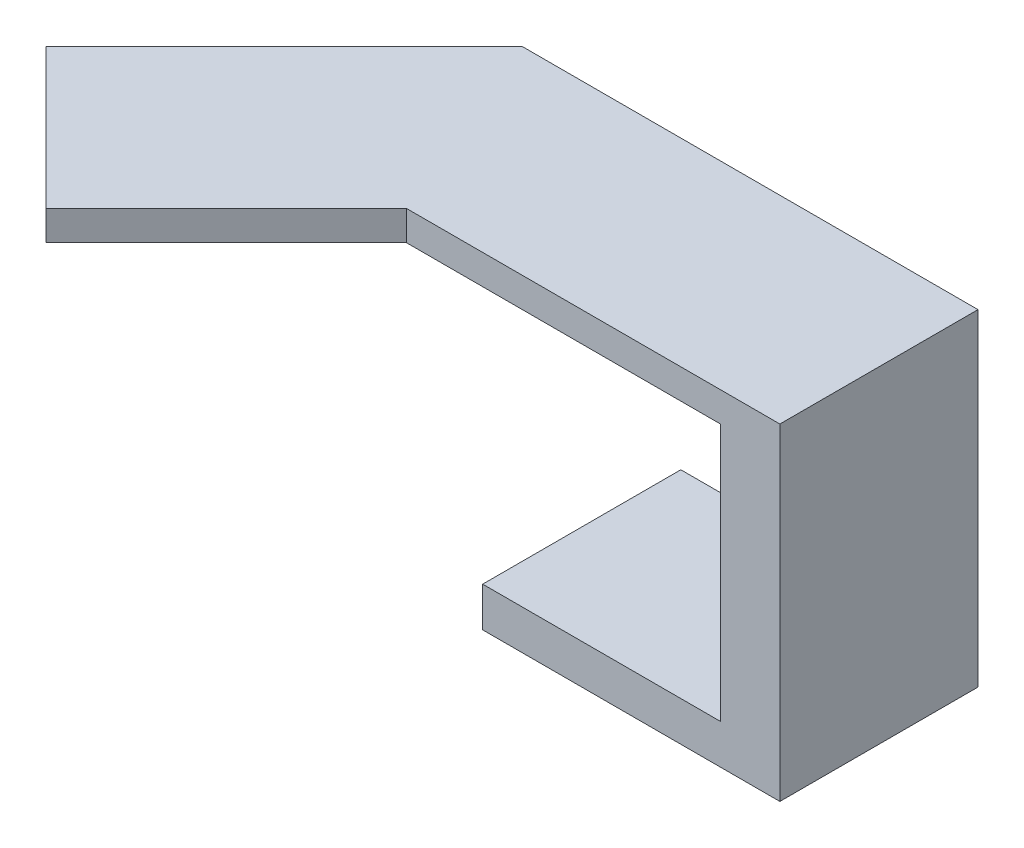
ISO-10303-21;
HEADER;
FILE_DESCRIPTION(('STEP AP214'),'2;1');
FILE_NAME('part.step','',(''),(''),'','','');
FILE_SCHEMA(('AUTOMOTIVE_DESIGN { 1 0 10303 214 1 1 1 1 }'));
ENDSEC;
DATA;
#1=APPLICATION_CONTEXT('core data for automotive mechanical design processes');
#2=APPLICATION_PROTOCOL_DEFINITION('international standard','automotive_design',2000,#1);
#3=PRODUCT_CONTEXT('',#1,'mechanical');
#4=PRODUCT('Part','Part','',(#3));
#5=PRODUCT_RELATED_PRODUCT_CATEGORY('part','',(#4));
#6=PRODUCT_DEFINITION_FORMATION('','',#4);
#7=PRODUCT_DEFINITION_CONTEXT('part definition',#1,'design');
#8=PRODUCT_DEFINITION('design','',#6,#7);
#9=PRODUCT_DEFINITION_SHAPE('','',#8);
#10=(LENGTH_UNIT() NAMED_UNIT(*) SI_UNIT(.MILLI.,.METRE.));
#11=(NAMED_UNIT(*) PLANE_ANGLE_UNIT() SI_UNIT($,.RADIAN.));
#12=(NAMED_UNIT(*) SI_UNIT($,.STERADIAN.) SOLID_ANGLE_UNIT());
#13=UNCERTAINTY_MEASURE_WITH_UNIT(LENGTH_MEASURE(1.E-05),#10,'distance_accuracy_value','');
#14=(GEOMETRIC_REPRESENTATION_CONTEXT(3) GLOBAL_UNCERTAINTY_ASSIGNED_CONTEXT((#13)) GLOBAL_UNIT_ASSIGNED_CONTEXT((#10,
#11,#12)) REPRESENTATION_CONTEXT('',''));
#15=CARTESIAN_POINT('',(0.,0.,0.));
#16=DIRECTION('',(0.,0.,1.));
#17=DIRECTION('',(1.,0.,0.));
#18=AXIS2_PLACEMENT_3D('',#15,#16,#17);
#19=CARTESIAN_POINT('',(9.74684507044105,-15.,5.54210655236567));
#20=DIRECTION('',(1.,0.,0.));
#21=DIRECTION('',(0.,0.,-1.));
#22=AXIS2_PLACEMENT_3D('',#19,#20,#21);
#23=PLANE('',#22);
#24=DIRECTION('',(0.,0.,-1.));
#25=VECTOR('',#24,1.);
#26=CARTESIAN_POINT('',(9.74684507044105,-13.,-4.45789344763433));
#27=LINE('',#26,#25);
#28=CARTESIAN_POINT('',(9.74684507044105,-13.,5.54210655236567));
#29=VERTEX_POINT('',#28);
#30=CARTESIAN_POINT('',(9.74684507044105,-13.,-4.45789344763433));
#31=VERTEX_POINT('',#30);
#32=EDGE_CURVE('E178',#29,#31,#27,.T.);
#33=ORIENTED_EDGE('',*,*,#32,.F.);
#34=DIRECTION('',(0.,1.,0.));
#35=VECTOR('',#34,1.);
#36=CARTESIAN_POINT('',(9.74684507044105,-15.,5.54210655236567));
#37=LINE('',#36,#35);
#38=CARTESIAN_POINT('',(9.74684507044105,0.,5.54210655236567));
#39=VERTEX_POINT('',#38);
#40=EDGE_CURVE('E48',#29,#39,#37,.T.);
#41=ORIENTED_EDGE('',*,*,#40,.T.);
#42=DIRECTION('',(0.,0.,-1.));
#43=VECTOR('',#42,1.);
#44=CARTESIAN_POINT('',(9.74684507044105,0.,5.54210655236567));
#45=LINE('',#44,#43);
#46=CARTESIAN_POINT('',(9.74684507044105,0.,-4.45789344763433));
#47=VERTEX_POINT('',#46);
#48=EDGE_CURVE('E142',#39,#47,#45,.T.);
#49=ORIENTED_EDGE('',*,*,#48,.T.);
#50=DIRECTION('',(0.,1.,0.));
#51=VECTOR('',#50,1.);
#52=CARTESIAN_POINT('',(9.74684507044105,-15.,-4.45789344763433));
#53=LINE('',#52,#51);
#54=EDGE_CURVE('E161',#31,#47,#53,.T.);
#55=ORIENTED_EDGE('',*,*,#54,.F.);
#56=EDGE_LOOP('',(#33,#41,#49,#55));
#57=FACE_BOUND('',#56,.T.);
#58=ADVANCED_FACE('F33',(#57),#23,.F.);
#59=CARTESIAN_POINT('',(12.7468450704411,1.5,5.54210655236567));
#60=DIRECTION('',(-1.,0.,0.));
#61=DIRECTION('',(0.,0.,1.));
#62=AXIS2_PLACEMENT_3D('',#59,#60,#61);
#63=PLANE('',#62);
#64=DIRECTION('',(0.,-1.,0.));
#65=VECTOR('',#64,1.);
#66=CARTESIAN_POINT('',(12.7468450704411,1.5,5.54210655236567));
#67=LINE('',#66,#65);
#68=CARTESIAN_POINT('',(12.7468450704411,1.5,5.54210655236567));
#69=VERTEX_POINT('',#68);
#70=CARTESIAN_POINT('',(12.7468450704411,-15.,5.54210655236567));
#71=VERTEX_POINT('',#70);
#72=EDGE_CURVE('E117',#69,#71,#67,.T.);
#73=ORIENTED_EDGE('',*,*,#72,.T.);
#74=DIRECTION('',(0.,0.,1.));
#75=VECTOR('',#74,1.);
#76=CARTESIAN_POINT('',(12.7468450704411,-15.,5.54210655236567));
#77=LINE('',#76,#75);
#78=CARTESIAN_POINT('',(12.7468450704411,-15.,-4.45789344763433));
#79=VERTEX_POINT('',#78);
#80=EDGE_CURVE('E166',#79,#71,#77,.T.);
#81=ORIENTED_EDGE('',*,*,#80,.F.);
#82=DIRECTION('',(0.,-1.,0.));
#83=VECTOR('',#82,1.);
#84=CARTESIAN_POINT('',(12.7468450704411,1.5,-4.45789344763433));
#85=LINE('',#84,#83);
#86=CARTESIAN_POINT('',(12.7468450704411,1.5,-4.45789344763433));
#87=VERTEX_POINT('',#86);
#88=EDGE_CURVE('E11',#87,#79,#85,.T.);
#89=ORIENTED_EDGE('',*,*,#88,.F.);
#90=DIRECTION('',(0.,0.,-1.));
#91=VECTOR('',#90,1.);
#92=CARTESIAN_POINT('',(12.7468450704411,1.5,5.54210655236567));
#93=LINE('',#92,#91);
#94=EDGE_CURVE('E130',#69,#87,#93,.T.);
#95=ORIENTED_EDGE('',*,*,#94,.F.);
#96=EDGE_LOOP('',(#73,#81,#89,#95));
#97=FACE_BOUND('',#96,.T.);
#98=ADVANCED_FACE('F35',(#97),#63,.F.);
#99=CARTESIAN_POINT('',(-10.2531549295589,1.5,-4.45789344763433));
#100=DIRECTION('',(0.,0.,1.));
#101=DIRECTION('',(1.,0.,0.));
#102=AXIS2_PLACEMENT_3D('',#99,#100,#101);
#103=PLANE('',#102);
#104=ORIENTED_EDGE('',*,*,#88,.T.);
#105=DIRECTION('',(1.,0.,0.));
#106=VECTOR('',#105,1.);
#107=CARTESIAN_POINT('',(12.7468450704411,-15.,-4.45789344763433));
#108=LINE('',#107,#106);
#109=CARTESIAN_POINT('',(-2.25315492955895,-15.,-4.45789344763433));
#110=VERTEX_POINT('',#109);
#111=EDGE_CURVE('E164',#110,#79,#108,.T.);
#112=ORIENTED_EDGE('',*,*,#111,.F.);
#113=DIRECTION('',(0.,-1.,0.));
#114=VECTOR('',#113,1.);
#115=CARTESIAN_POINT('',(-2.25315492955895,-15.,-4.45789344763433));
#116=LINE('',#115,#114);
#117=CARTESIAN_POINT('',(-2.25315492955895,-13.,-4.45789344763433));
#118=VERTEX_POINT('',#117);
#119=EDGE_CURVE('E181',#118,#110,#116,.T.);
#120=ORIENTED_EDGE('',*,*,#119,.F.);
#121=DIRECTION('',(1.,0.,0.));
#122=VECTOR('',#121,1.);
#123=CARTESIAN_POINT('',(-2.25315492955895,-13.,-4.45789344763433));
#124=LINE('',#123,#122);
#125=EDGE_CURVE('E174',#118,#31,#124,.T.);
#126=ORIENTED_EDGE('',*,*,#125,.T.);
#127=ORIENTED_EDGE('',*,*,#54,.T.);
#128=DIRECTION('',(-1.,0.,0.));
#129=VECTOR('',#128,1.);
#130=CARTESIAN_POINT('',(-10.2531549295589,0.,-4.45789344763433));
#131=LINE('',#130,#129);
#132=CARTESIAN_POINT('',(-10.2531549295589,0.,-4.45789344763433));
#133=VERTEX_POINT('',#132);
#134=EDGE_CURVE('E121',#47,#133,#131,.T.);
#135=ORIENTED_EDGE('',*,*,#134,.T.);
#136=DIRECTION('',(0.,-1.,0.));
#137=VECTOR('',#136,1.);
#138=CARTESIAN_POINT('',(-10.2531549295589,1.5,-4.45789344763433));
#139=LINE('',#138,#137);
#140=CARTESIAN_POINT('',(-10.2531549295589,1.5,-4.45789344763433));
#141=VERTEX_POINT('',#140);
#142=EDGE_CURVE('E41',#141,#133,#139,.T.);
#143=ORIENTED_EDGE('',*,*,#142,.F.);
#144=DIRECTION('',(-1.,0.,0.));
#145=VECTOR('',#144,1.);
#146=CARTESIAN_POINT('',(-10.2531549295589,1.5,-4.45789344763433));
#147=LINE('',#146,#145);
#148=EDGE_CURVE('E87',#87,#141,#147,.T.);
#149=ORIENTED_EDGE('',*,*,#148,.F.);
#150=EDGE_LOOP('',(#104,#112,#120,#126,#127,#135,#143,#149));
#151=FACE_BOUND('',#150,.T.);
#152=ADVANCED_FACE('F203',(#151),#103,.F.);
#153=CARTESIAN_POINT('',(-10.2531549295589,1.5,-4.45789344763433));
#154=DIRECTION('',(0.707106781186544,0.,0.707106781186551));
#155=DIRECTION('',(0.707106781186551,0.,-0.707106781186544));
#156=AXIS2_PLACEMENT_3D('',#153,#154,#155);
#157=PLANE('',#156);
#158=DIRECTION('',(-0.707106781186551,0.,0.707106781186544));
#159=VECTOR('',#158,1.);
#160=CARTESIAN_POINT('',(-10.2531549295589,0.,-4.45789344763433));
#161=LINE('',#160,#159);
#162=CARTESIAN_POINT('',(-22.2739702097303,0.,7.56292183253692));
#163=VERTEX_POINT('',#162);
#164=EDGE_CURVE('E123',#133,#163,#161,.T.);
#165=ORIENTED_EDGE('',*,*,#164,.T.);
#166=DIRECTION('',(0.,-1.,0.));
#167=VECTOR('',#166,1.);
#168=CARTESIAN_POINT('',(-22.2739702097303,1.5,7.56292183253692));
#169=LINE('',#168,#167);
#170=CARTESIAN_POINT('',(-22.2739702097303,1.5,7.56292183253692));
#171=VERTEX_POINT('',#170);
#172=EDGE_CURVE('E112',#171,#163,#169,.T.);
#173=ORIENTED_EDGE('',*,*,#172,.F.);
#174=DIRECTION('',(-0.707106781186551,0.,0.707106781186544));
#175=VECTOR('',#174,1.);
#176=CARTESIAN_POINT('',(-10.2531549295589,1.5,-4.45789344763433));
#177=LINE('',#176,#175);
#178=EDGE_CURVE('E103',#141,#171,#177,.T.);
#179=ORIENTED_EDGE('',*,*,#178,.F.);
#180=ORIENTED_EDGE('',*,*,#142,.T.);
#181=EDGE_LOOP('',(#165,#173,#179,#180));
#182=FACE_BOUND('',#181,.T.);
#183=ADVANCED_FACE('F137',(#182),#157,.F.);
#184=CARTESIAN_POINT('',(-22.2739702097303,1.5,7.56292183253692));
#185=DIRECTION('',(0.707106781186551,0.,-0.707106781186544));
#186=DIRECTION('',(-0.707106781186544,0.,-0.707106781186551));
#187=AXIS2_PLACEMENT_3D('',#184,#185,#186);
#188=PLANE('',#187);
#189=DIRECTION('',(0.707106781186544,0.,0.707106781186551));
#190=VECTOR('',#189,1.);
#191=CARTESIAN_POINT('',(-22.2739702097303,0.,7.56292183253692));
#192=LINE('',#191,#190);
#193=CARTESIAN_POINT('',(-15.2029023978649,0.,14.6339896444024));
#194=VERTEX_POINT('',#193);
#195=EDGE_CURVE('E111',#163,#194,#192,.T.);
#196=ORIENTED_EDGE('',*,*,#195,.T.);
#197=DIRECTION('',(0.,-1.,0.));
#198=VECTOR('',#197,1.);
#199=CARTESIAN_POINT('',(-15.2029023978649,1.5,14.6339896444024));
#200=LINE('',#199,#198);
#201=CARTESIAN_POINT('',(-15.2029023978649,1.5,14.6339896444024));
#202=VERTEX_POINT('',#201);
#203=EDGE_CURVE('E108',#202,#194,#200,.T.);
#204=ORIENTED_EDGE('',*,*,#203,.F.);
#205=DIRECTION('',(0.707106781186544,0.,0.707106781186551));
#206=VECTOR('',#205,1.);
#207=CARTESIAN_POINT('',(-22.2739702097303,1.5,7.56292183253692));
#208=LINE('',#207,#206);
#209=EDGE_CURVE('E97',#171,#202,#208,.T.);
#210=ORIENTED_EDGE('',*,*,#209,.F.);
#211=ORIENTED_EDGE('',*,*,#172,.T.);
#212=EDGE_LOOP('',(#196,#204,#210,#211));
#213=FACE_BOUND('',#212,.T.);
#214=ADVANCED_FACE('F109',(#213),#188,.F.);
#215=CARTESIAN_POINT('',(-15.2029023978649,1.5,14.6339896444024));
#216=DIRECTION('',(-0.707106781186544,0.,-0.707106781186551));
#217=DIRECTION('',(-0.707106781186551,0.,0.707106781186544));
#218=AXIS2_PLACEMENT_3D('',#215,#216,#217);
#219=PLANE('',#218);
#220=DIRECTION('',(0.707106781186551,0.,-0.707106781186544));
#221=VECTOR('',#220,1.);
#222=CARTESIAN_POINT('',(-15.2029023978649,0.,14.6339896444024));
#223=LINE('',#222,#221);
#224=CARTESIAN_POINT('',(-6.11101930582803,0.,5.54210655236567));
#225=VERTEX_POINT('',#224);
#226=EDGE_CURVE('E79',#194,#225,#223,.T.);
#227=ORIENTED_EDGE('',*,*,#226,.T.);
#228=DIRECTION('',(0.,-1.,0.));
#229=VECTOR('',#228,1.);
#230=CARTESIAN_POINT('',(-6.11101930582803,1.5,5.54210655236567));
#231=LINE('',#230,#229);
#232=CARTESIAN_POINT('',(-6.11101930582803,1.5,5.54210655236567));
#233=VERTEX_POINT('',#232);
#234=EDGE_CURVE('E113',#233,#225,#231,.T.);
#235=ORIENTED_EDGE('',*,*,#234,.F.);
#236=DIRECTION('',(0.707106781186551,0.,-0.707106781186544));
#237=VECTOR('',#236,1.);
#238=CARTESIAN_POINT('',(-15.2029023978649,1.5,14.6339896444024));
#239=LINE('',#238,#237);
#240=EDGE_CURVE('E101',#202,#233,#239,.T.);
#241=ORIENTED_EDGE('',*,*,#240,.F.);
#242=ORIENTED_EDGE('',*,*,#203,.T.);
#243=EDGE_LOOP('',(#227,#235,#241,#242));
#244=FACE_BOUND('',#243,.T.);
#245=ADVANCED_FACE('F115',(#244),#219,.F.);
#246=CARTESIAN_POINT('',(-6.11101930582803,1.5,5.54210655236567));
#247=DIRECTION('',(0.,0.,-1.));
#248=DIRECTION('',(-1.,0.,0.));
#249=AXIS2_PLACEMENT_3D('',#246,#247,#248);
#250=PLANE('',#249);
#251=DIRECTION('',(1.,0.,0.));
#252=VECTOR('',#251,1.);
#253=CARTESIAN_POINT('',(-6.11101930582803,0.,5.54210655236567));
#254=LINE('',#253,#252);
#255=EDGE_CURVE('E127',#225,#39,#254,.T.);
#256=ORIENTED_EDGE('',*,*,#255,.T.);
#257=ORIENTED_EDGE('',*,*,#40,.F.);
#258=DIRECTION('',(1.,0.,0.));
#259=VECTOR('',#258,1.);
#260=CARTESIAN_POINT('',(-2.25315492955895,-13.,5.54210655236567));
#261=LINE('',#260,#259);
#262=CARTESIAN_POINT('',(-2.25315492955895,-13.,5.54210655236567));
#263=VERTEX_POINT('',#262);
#264=EDGE_CURVE('E167',#263,#29,#261,.T.);
#265=ORIENTED_EDGE('',*,*,#264,.F.);
#266=DIRECTION('',(0.,1.,0.));
#267=VECTOR('',#266,1.);
#268=CARTESIAN_POINT('',(-2.25315492955895,-15.,5.54210655236567));
#269=LINE('',#268,#267);
#270=CARTESIAN_POINT('',(-2.25315492955895,-15.,5.54210655236567));
#271=VERTEX_POINT('',#270);
#272=EDGE_CURVE('E184',#271,#263,#269,.T.);
#273=ORIENTED_EDGE('',*,*,#272,.F.);
#274=DIRECTION('',(-1.,0.,0.));
#275=VECTOR('',#274,1.);
#276=CARTESIAN_POINT('',(12.7468450704411,-15.,5.54210655236567));
#277=LINE('',#276,#275);
#278=EDGE_CURVE('E152',#71,#271,#277,.T.);
#279=ORIENTED_EDGE('',*,*,#278,.F.);
#280=ORIENTED_EDGE('',*,*,#72,.F.);
#281=DIRECTION('',(1.,0.,0.));
#282=VECTOR('',#281,1.);
#283=CARTESIAN_POINT('',(-6.11101930582803,1.5,5.54210655236567));
#284=LINE('',#283,#282);
#285=EDGE_CURVE('E57',#233,#69,#284,.T.);
#286=ORIENTED_EDGE('',*,*,#285,.F.);
#287=ORIENTED_EDGE('',*,*,#234,.T.);
#288=EDGE_LOOP('',(#256,#257,#265,#273,#279,#280,#286,#287));
#289=FACE_BOUND('',#288,.T.);
#290=ADVANCED_FACE('F144',(#289),#250,.F.);
#291=CARTESIAN_POINT('',(0.,1.5,0.));
#292=DIRECTION('',(0.,-1.,0.));
#293=DIRECTION('',(0.,0.,-1.));
#294=AXIS2_PLACEMENT_3D('',#291,#292,#293);
#295=PLANE('',#294);
#296=ORIENTED_EDGE('',*,*,#94,.T.);
#297=ORIENTED_EDGE('',*,*,#148,.T.);
#298=ORIENTED_EDGE('',*,*,#178,.T.);
#299=ORIENTED_EDGE('',*,*,#209,.T.);
#300=ORIENTED_EDGE('',*,*,#240,.T.);
#301=ORIENTED_EDGE('',*,*,#285,.T.);
#302=EDGE_LOOP('',(#296,#297,#298,#299,#300,#301));
#303=FACE_BOUND('',#302,.T.);
#304=ADVANCED_FACE('F99',(#303),#295,.F.);
#305=CARTESIAN_POINT('',(0.,0.,0.));
#306=DIRECTION('',(0.,-1.,0.));
#307=DIRECTION('',(0.,0.,-1.));
#308=AXIS2_PLACEMENT_3D('',#305,#306,#307);
#309=PLANE('',#308);
#310=ORIENTED_EDGE('',*,*,#48,.F.);
#311=ORIENTED_EDGE('',*,*,#255,.F.);
#312=ORIENTED_EDGE('',*,*,#226,.F.);
#313=ORIENTED_EDGE('',*,*,#195,.F.);
#314=ORIENTED_EDGE('',*,*,#164,.F.);
#315=ORIENTED_EDGE('',*,*,#134,.F.);
#316=EDGE_LOOP('',(#310,#311,#312,#313,#314,#315));
#317=FACE_BOUND('',#316,.T.);
#318=ADVANCED_FACE('F140',(#317),#309,.T.);
#319=CARTESIAN_POINT('',(0.,-15.,0.));
#320=DIRECTION('',(0.,1.,0.));
#321=DIRECTION('',(0.,0.,1.));
#322=AXIS2_PLACEMENT_3D('',#319,#320,#321);
#323=PLANE('',#322);
#324=ORIENTED_EDGE('',*,*,#80,.T.);
#325=ORIENTED_EDGE('',*,*,#278,.T.);
#326=DIRECTION('',(0.,0.,1.));
#327=VECTOR('',#326,1.);
#328=CARTESIAN_POINT('',(-2.25315492955895,-15.,-4.45789344763433));
#329=LINE('',#328,#327);
#330=EDGE_CURVE('E187',#110,#271,#329,.T.);
#331=ORIENTED_EDGE('',*,*,#330,.F.);
#332=ORIENTED_EDGE('',*,*,#111,.T.);
#333=EDGE_LOOP('',(#324,#325,#331,#332));
#334=FACE_BOUND('',#333,.T.);
#335=ADVANCED_FACE('F213',(#334),#323,.F.);
#336=CARTESIAN_POINT('',(-2.25315492955895,-13.,-4.45789344763433));
#337=DIRECTION('',(0.,-1.,0.));
#338=DIRECTION('',(0.,0.,-1.));
#339=AXIS2_PLACEMENT_3D('',#336,#337,#338);
#340=PLANE('',#339);
#341=ORIENTED_EDGE('',*,*,#32,.T.);
#342=ORIENTED_EDGE('',*,*,#125,.F.);
#343=DIRECTION('',(0.,0.,-1.));
#344=VECTOR('',#343,1.);
#345=CARTESIAN_POINT('',(-2.25315492955895,-13.,-4.45789344763433));
#346=LINE('',#345,#344);
#347=EDGE_CURVE('E177',#263,#118,#346,.T.);
#348=ORIENTED_EDGE('',*,*,#347,.F.);
#349=ORIENTED_EDGE('',*,*,#264,.T.);
#350=EDGE_LOOP('',(#341,#342,#348,#349));
#351=FACE_BOUND('',#350,.T.);
#352=ADVANCED_FACE('F215',(#351),#340,.F.);
#353=CARTESIAN_POINT('',(-2.25315492955895,0.,0.));
#354=DIRECTION('',(1.,0.,0.));
#355=DIRECTION('',(0.,0.,-1.));
#356=AXIS2_PLACEMENT_3D('',#353,#354,#355);
#357=PLANE('',#356);
#358=ORIENTED_EDGE('',*,*,#119,.T.);
#359=ORIENTED_EDGE('',*,*,#330,.T.);
#360=ORIENTED_EDGE('',*,*,#272,.T.);
#361=ORIENTED_EDGE('',*,*,#347,.T.);
#362=EDGE_LOOP('',(#358,#359,#360,#361));
#363=FACE_BOUND('',#362,.T.);
#364=ADVANCED_FACE('F194',(#363),#357,.F.);
#365=CLOSED_SHELL('',(#58,#98,#152,#183,#214,#245,#290,#304,#318,#335,#352,#364));
#366=MANIFOLD_SOLID_BREP('B2',#365);
#367=ADVANCED_BREP_SHAPE_REPRESENTATION('',(#18,#366),#14);
#368=SHAPE_DEFINITION_REPRESENTATION(#9,#367);
ENDSEC;
END-ISO-10303-21;
